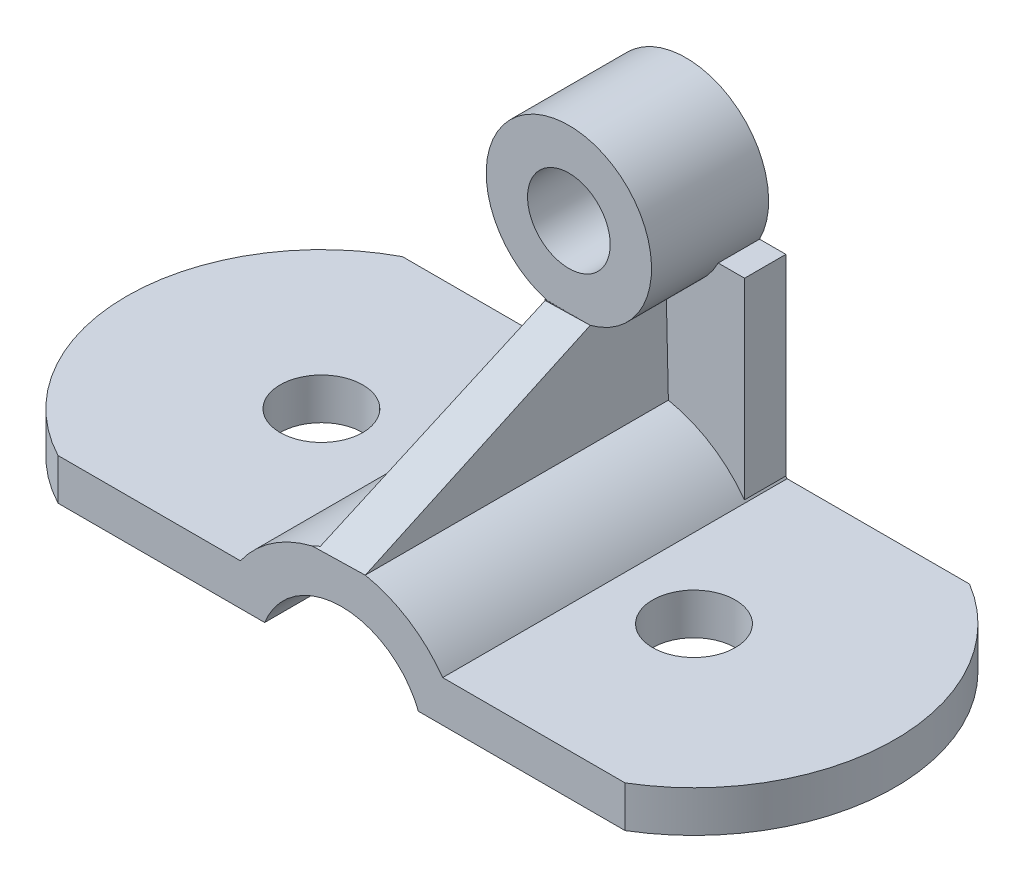
ISO-10303-21;
HEADER;
FILE_DESCRIPTION(('STEP AP214'),'2;1');
FILE_NAME('part.step','',(''),(''),'','','');
FILE_SCHEMA(('AUTOMOTIVE_DESIGN { 1 0 10303 214 1 1 1 1 }'));
ENDSEC;
DATA;
#1=APPLICATION_CONTEXT('core data for automotive mechanical design processes');
#2=APPLICATION_PROTOCOL_DEFINITION('international standard','automotive_design',2000,#1);
#3=PRODUCT_CONTEXT('',#1,'mechanical');
#4=PRODUCT('Part','Part','',(#3));
#5=PRODUCT_RELATED_PRODUCT_CATEGORY('part','',(#4));
#6=PRODUCT_DEFINITION_FORMATION('','',#4);
#7=PRODUCT_DEFINITION_CONTEXT('part definition',#1,'design');
#8=PRODUCT_DEFINITION('design','',#6,#7);
#9=PRODUCT_DEFINITION_SHAPE('','',#8);
#10=(LENGTH_UNIT() NAMED_UNIT(*) SI_UNIT(.MILLI.,.METRE.));
#11=(NAMED_UNIT(*) PLANE_ANGLE_UNIT() SI_UNIT($,.RADIAN.));
#12=(NAMED_UNIT(*) SI_UNIT($,.STERADIAN.) SOLID_ANGLE_UNIT());
#13=UNCERTAINTY_MEASURE_WITH_UNIT(LENGTH_MEASURE(1.E-05),#10,'distance_accuracy_value','');
#14=(GEOMETRIC_REPRESENTATION_CONTEXT(3) GLOBAL_UNCERTAINTY_ASSIGNED_CONTEXT((#13)) GLOBAL_UNIT_ASSIGNED_CONTEXT((#10,
#11,#12)) REPRESENTATION_CONTEXT('',''));
#15=CARTESIAN_POINT('',(0.,0.,0.));
#16=DIRECTION('',(0.,0.,1.));
#17=DIRECTION('',(1.,0.,0.));
#18=AXIS2_PLACEMENT_3D('',#15,#16,#17);
#19=CARTESIAN_POINT('',(22.3187070087078,-8.82469928436413,100.));
#20=DIRECTION('',(0.,0.,-1.));
#21=DIRECTION('',(-1.,0.,0.));
#22=AXIS2_PLACEMENT_3D('',#19,#20,#21);
#23=CYLINDRICAL_SURFACE('',#22,36.);
#24=DIRECTION('',(0.,0.,-1.));
#25=VECTOR('',#24,1.);
#26=CARTESIAN_POINT('',(29.206614960219,26.5102228756111,100.));
#27=LINE('',#26,#25);
#28=CARTESIAN_POINT('',(29.206614960219,26.5102228756111,100.));
#29=VERTEX_POINT('',#28);
#30=CARTESIAN_POINT('',(29.206614960219,26.5102228756111,12.));
#31=VERTEX_POINT('',#30);
#32=EDGE_CURVE('E274',#29,#31,#27,.T.);
#33=ORIENTED_EDGE('',*,*,#32,.F.);
#34=CARTESIAN_POINT('',(22.3187070087078,-8.82469928436413,100.));
#35=DIRECTION('',(0.,0.,1.));
#36=DIRECTION('',(1.,0.,0.));
#37=AXIS2_PLACEMENT_3D('',#34,#35,#36);
#38=CIRCLE('',#37,36.);
#39=CARTESIAN_POINT('',(51.6841952511295,12.,100.));
#40=VERTEX_POINT('',#39);
#41=EDGE_CURVE('E379',#40,#29,#38,.T.);
#42=ORIENTED_EDGE('',*,*,#41,.F.);
#43=DIRECTION('',(0.,0.,-1.));
#44=VECTOR('',#43,1.);
#45=CARTESIAN_POINT('',(51.6841952511295,12.,100.));
#46=LINE('',#45,#44);
#47=CARTESIAN_POINT('',(51.6841952511295,12.,0.));
#48=VERTEX_POINT('',#47);
#49=EDGE_CURVE('E415',#40,#48,#46,.T.);
#50=ORIENTED_EDGE('',*,*,#49,.T.);
#51=CARTESIAN_POINT('',(22.3187070087078,-8.82469928436413,0.));
#52=DIRECTION('',(0.,0.,1.));
#53=DIRECTION('',(1.,0.,0.));
#54=AXIS2_PLACEMENT_3D('',#51,#52,#53);
#55=CIRCLE('',#54,36.);
#56=CARTESIAN_POINT('',(51.3187070087078,12.5060297233374,0.));
#57=VERTEX_POINT('',#56);
#58=EDGE_CURVE('E401',#48,#57,#55,.T.);
#59=ORIENTED_EDGE('',*,*,#58,.T.);
#60=DIRECTION('',(0.,0.,-1.));
#61=VECTOR('',#60,1.);
#62=CARTESIAN_POINT('',(51.3187070087078,12.5060297233374,100.));
#63=LINE('',#62,#61);
#64=CARTESIAN_POINT('',(51.3187070087078,12.5060297233374,12.));
#65=VERTEX_POINT('',#64);
#66=EDGE_CURVE('E335',#65,#57,#63,.T.);
#67=ORIENTED_EDGE('',*,*,#66,.F.);
#68=CARTESIAN_POINT('',(22.3187070087078,-8.82469928436413,12.));
#69=DIRECTION('',(0.,0.,1.));
#70=DIRECTION('',(0.,-1.,0.));
#71=AXIS2_PLACEMENT_3D('',#68,#69,#70);
#72=CIRCLE('',#71,36.);
#73=EDGE_CURVE('E424',#65,#31,#72,.T.);
#74=ORIENTED_EDGE('',*,*,#73,.T.);
#75=EDGE_LOOP('',(#33,#42,#50,#59,#67,#74));
#76=FACE_BOUND('',#75,.T.);
#77=ADVANCED_FACE('F41',(#76),#23,.T.);
#78=CARTESIAN_POINT('',(13.8037736654294,26.1538071182759,100.));
#79=VERTEX_POINT('',#78);
#80=CARTESIAN_POINT('',(-7.04678123371384,12.,100.));
#81=VERTEX_POINT('',#80);
#82=EDGE_CURVE('E378',#79,#81,#38,.T.);
#83=ORIENTED_EDGE('',*,*,#82,.F.);
#84=CARTESIAN_POINT('',(22.3187070087078,-8.82469928436413,178.705674509862));
#85=DIRECTION('',(0.0211210367011272,-0.912765413968115,-0.407937741416855));
#86=DIRECTION('',(-0.00943699454614576,0.407828571836527,-0.913009747553505));
#87=AXIS2_PLACEMENT_3D('',#84,#85,#86);
#88=ELLIPSE('',#87,88.2487603989871,36.);
#89=CARTESIAN_POINT('',(15.4307990571966,26.5102228756111,99.2867551007535));
#90=VERTEX_POINT('',#89);
#91=EDGE_CURVE('E267',#79,#90,#88,.T.);
#92=ORIENTED_EDGE('',*,*,#91,.T.);
#93=DIRECTION('',(0.,0.,-1.));
#94=VECTOR('',#93,1.);
#95=CARTESIAN_POINT('',(15.4307990571966,26.5102228756111,100.));
#96=LINE('',#95,#94);
#97=CARTESIAN_POINT('',(15.4307990571967,26.5102228756111,12.));
#98=VERTEX_POINT('',#97);
#99=EDGE_CURVE('E277',#90,#98,#96,.T.);
#100=ORIENTED_EDGE('',*,*,#99,.T.);
#101=CARTESIAN_POINT('',(-1.68129299129219,18.0081164456333,12.));
#102=VERTEX_POINT('',#101);
#103=EDGE_CURVE('E421',#98,#102,#72,.T.);
#104=ORIENTED_EDGE('',*,*,#103,.T.);
#105=DIRECTION('',(0.,0.,-1.));
#106=VECTOR('',#105,1.);
#107=CARTESIAN_POINT('',(-1.68129299129219,18.0081164456333,100.));
#108=LINE('',#107,#106);
#109=CARTESIAN_POINT('',(-1.68129299129219,18.0081164456334,0.));
#110=VERTEX_POINT('',#109);
#111=EDGE_CURVE('E322',#102,#110,#108,.T.);
#112=ORIENTED_EDGE('',*,*,#111,.T.);
#113=CARTESIAN_POINT('',(-7.04678123371384,12.,0.));
#114=VERTEX_POINT('',#113);
#115=EDGE_CURVE('E400',#110,#114,#55,.T.);
#116=ORIENTED_EDGE('',*,*,#115,.T.);
#117=DIRECTION('',(0.,0.,-1.));
#118=VECTOR('',#117,1.);
#119=CARTESIAN_POINT('',(-7.04678123371384,12.,100.));
#120=LINE('',#119,#118);
#121=EDGE_CURVE('E412',#81,#114,#120,.T.);
#122=ORIENTED_EDGE('',*,*,#121,.F.);
#123=EDGE_LOOP('',(#83,#92,#100,#104,#112,#116,#122));
#124=FACE_BOUND('',#123,.T.);
#125=ADVANCED_FACE('F452',(#124),#23,.T.);
#126=CARTESIAN_POINT('',(51.3187070087078,68.2352134699063,12.));
#127=DIRECTION('',(0.,0.,1.));
#128=DIRECTION('',(0.,-1.,0.));
#129=AXIS2_PLACEMENT_3D('',#126,#127,#128);
#130=PLANE('',#129);
#131=CARTESIAN_POINT('',(22.3187070087078,79.1753007156359,12.));
#132=DIRECTION('',(0.,0.,1.));
#133=DIRECTION('',(0.,-1.,0.));
#134=AXIS2_PLACEMENT_3D('',#131,#132,#133);
#135=CIRCLE('',#134,24.);
#136=CARTESIAN_POINT('',(43.6802259400906,68.2352134699063,12.));
#137=VERTEX_POINT('',#136);
#138=CARTESIAN_POINT('',(28.5244298666703,55.9914916280385,12.));
#139=VERTEX_POINT('',#138);
#140=EDGE_CURVE('E300',#137,#139,#135,.F.);
#141=ORIENTED_EDGE('',*,*,#140,.T.);
#142=DIRECTION('',(0.0231334186274824,-0.999732386662854,0.));
#143=VECTOR('',#142,1.);
#144=CARTESIAN_POINT('',(28.2534649950084,67.7014927398735,12.));
#145=LINE('',#144,#143);
#146=EDGE_CURVE('E285',#139,#31,#145,.T.);
#147=ORIENTED_EDGE('',*,*,#146,.T.);
#148=ORIENTED_EDGE('',*,*,#73,.F.);
#149=DIRECTION('',(0.,1.,0.));
#150=VECTOR('',#149,1.);
#151=CARTESIAN_POINT('',(51.3187070087078,68.2352134699063,12.));
#152=LINE('',#151,#150);
#153=CARTESIAN_POINT('',(51.3187070087078,68.2352134699063,12.));
#154=VERTEX_POINT('',#153);
#155=EDGE_CURVE('E307',#65,#154,#152,.T.);
#156=ORIENTED_EDGE('',*,*,#155,.T.);
#157=DIRECTION('',(-1.,0.,0.));
#158=VECTOR('',#157,1.);
#159=CARTESIAN_POINT('',(51.3187070087078,68.2352134699063,12.));
#160=LINE('',#159,#158);
#161=EDGE_CURVE('E324',#154,#137,#160,.T.);
#162=ORIENTED_EDGE('',*,*,#161,.T.);
#163=EDGE_LOOP('',(#141,#147,#148,#156,#162));
#164=FACE_BOUND('',#163,.T.);
#165=ADVANCED_FACE('F468',(#164),#130,.T.);
#166=DIRECTION('',(0.,-1.,0.));
#167=VECTOR('',#166,1.);
#168=CARTESIAN_POINT('',(15.4307990571966,68.2352134699063,12.));
#169=LINE('',#168,#167);
#170=CARTESIAN_POINT('',(15.4307990571966,55.9914916280385,12.));
#171=VERTEX_POINT('',#170);
#172=EDGE_CURVE('E440',#171,#98,#169,.T.);
#173=ORIENTED_EDGE('',*,*,#172,.F.);
#174=DIRECTION('',(1.,0.,0.));
#175=VECTOR('',#174,1.);
#176=CARTESIAN_POINT('',(51.3187070087078,55.9914916280385,12.));
#177=LINE('',#176,#175);
#178=CARTESIAN_POINT('',(16.1129841507453,55.9914916280385,12.));
#179=VERTEX_POINT('',#178);
#180=EDGE_CURVE('E283',#171,#179,#177,.T.);
#181=ORIENTED_EDGE('',*,*,#180,.T.);
#182=CARTESIAN_POINT('',(0.957188077325033,68.2352134699063,12.));
#183=VERTEX_POINT('',#182);
#184=EDGE_CURVE('E297',#179,#183,#135,.F.);
#185=ORIENTED_EDGE('',*,*,#184,.T.);
#186=CARTESIAN_POINT('',(-1.68129299129219,68.2352134699063,12.));
#187=VERTEX_POINT('',#186);
#188=EDGE_CURVE('E327',#183,#187,#160,.T.);
#189=ORIENTED_EDGE('',*,*,#188,.T.);
#190=DIRECTION('',(0.,1.,0.));
#191=VECTOR('',#190,1.);
#192=CARTESIAN_POINT('',(-1.68129299129219,68.2352134699063,12.));
#193=LINE('',#192,#191);
#194=EDGE_CURVE('E315',#102,#187,#193,.T.);
#195=ORIENTED_EDGE('',*,*,#194,.F.);
#196=ORIENTED_EDGE('',*,*,#103,.F.);
#197=EDGE_LOOP('',(#173,#181,#185,#189,#195,#196));
#198=FACE_BOUND('',#197,.T.);
#199=ADVANCED_FACE('F490',(#198),#130,.T.);
#200=CARTESIAN_POINT('',(22.3187070087078,79.1753007156359,34.));
#201=DIRECTION('',(0.,0.,1.));
#202=DIRECTION('',(1.,0.,0.));
#203=AXIS2_PLACEMENT_3D('',#200,#201,#202);
#204=PLANE('',#203);
#205=CARTESIAN_POINT('',(22.3187070087078,79.1753007156359,34.));
#206=DIRECTION('',(0.,0.,1.));
#207=DIRECTION('',(1.,0.,0.));
#208=AXIS2_PLACEMENT_3D('',#205,#206,#207);
#209=CIRCLE('',#208,12.);
#210=CARTESIAN_POINT('',(34.3187070087078,79.1753007156359,34.));
#211=VERTEX_POINT('',#210);
#212=EDGE_CURVE('E288',#211,#211,#209,.T.);
#213=ORIENTED_EDGE('',*,*,#212,.F.);
#214=EDGE_LOOP('',(#213));
#215=FACE_BOUND('',#214,.T.);
#216=CARTESIAN_POINT('',(22.3187070087078,79.1753007156359,34.));
#217=DIRECTION('',(0.,0.,1.));
#218=DIRECTION('',(1.,0.,0.));
#219=AXIS2_PLACEMENT_3D('',#216,#217,#218);
#220=CIRCLE('',#219,24.);
#221=CARTESIAN_POINT('',(28.5244298666703,55.9914916280385,34.));
#222=VERTEX_POINT('',#221);
#223=CARTESIAN_POINT('',(16.1129841507453,55.9914916280385,34.));
#224=VERTEX_POINT('',#223);
#225=EDGE_CURVE('E294',#222,#224,#220,.T.);
#226=ORIENTED_EDGE('',*,*,#225,.T.);
#227=DIRECTION('',(1.,0.,0.));
#228=VECTOR('',#227,1.);
#229=CARTESIAN_POINT('',(22.3187070087078,55.9914916280385,34.));
#230=LINE('',#229,#228);
#231=EDGE_CURVE('E280',#224,#222,#230,.T.);
#232=ORIENTED_EDGE('',*,*,#231,.T.);
#233=EDGE_LOOP('',(#226,#232));
#234=FACE_BOUND('',#233,.T.);
#235=ADVANCED_FACE('F485',(#215,#234),#204,.T.);
#236=CARTESIAN_POINT('',(22.3187070087078,79.1753007156359,34.));
#237=DIRECTION('',(0.,0.,-1.));
#238=DIRECTION('',(-1.,0.,0.));
#239=AXIS2_PLACEMENT_3D('',#236,#237,#238);
#240=CYLINDRICAL_SURFACE('',#239,24.);
#241=DIRECTION('',(0.,0.,-1.));
#242=VECTOR('',#241,1.);
#243=CARTESIAN_POINT('',(16.1129841507453,55.9914916280385,34.));
#244=LINE('',#243,#242);
#245=EDGE_CURVE('E437',#224,#179,#244,.T.);
#246=ORIENTED_EDGE('',*,*,#245,.F.);
#247=ORIENTED_EDGE('',*,*,#225,.F.);
#248=DIRECTION('',(0.,0.,-1.));
#249=VECTOR('',#248,1.);
#250=CARTESIAN_POINT('',(28.5244298666703,55.9914916280385,34.));
#251=LINE('',#250,#249);
#252=EDGE_CURVE('E434',#139,#222,#251,.F.);
#253=ORIENTED_EDGE('',*,*,#252,.F.);
#254=ORIENTED_EDGE('',*,*,#140,.F.);
#255=DIRECTION('',(0.,0.,-1.));
#256=VECTOR('',#255,1.);
#257=CARTESIAN_POINT('',(43.6802259400906,68.2352134699063,34.));
#258=LINE('',#257,#256);
#259=CARTESIAN_POINT('',(43.6802259400906,68.2352134699063,0.));
#260=VERTEX_POINT('',#259);
#261=EDGE_CURVE('E432',#260,#137,#258,.F.);
#262=ORIENTED_EDGE('',*,*,#261,.F.);
#263=CARTESIAN_POINT('',(22.3187070087078,79.1753007156359,0.));
#264=DIRECTION('',(0.,0.,1.));
#265=DIRECTION('',(1.,0.,0.));
#266=AXIS2_PLACEMENT_3D('',#263,#264,#265);
#267=CIRCLE('',#266,24.);
#268=CARTESIAN_POINT('',(0.957188077325033,68.2352134699063,0.));
#269=VERTEX_POINT('',#268);
#270=EDGE_CURVE('E291',#260,#269,#267,.T.);
#271=ORIENTED_EDGE('',*,*,#270,.T.);
#272=DIRECTION('',(0.,0.,-1.));
#273=VECTOR('',#272,1.);
#274=CARTESIAN_POINT('',(0.957188077325033,68.2352134699063,34.));
#275=LINE('',#274,#273);
#276=EDGE_CURVE('E430',#183,#269,#275,.T.);
#277=ORIENTED_EDGE('',*,*,#276,.F.);
#278=ORIENTED_EDGE('',*,*,#184,.F.);
#279=EDGE_LOOP('',(#246,#247,#253,#254,#262,#271,#277,#278));
#280=FACE_BOUND('',#279,.T.);
#281=ADVANCED_FACE('F479',(#280),#240,.T.);
#282=CARTESIAN_POINT('',(51.3187070087078,68.2352134699063,0.));
#283=DIRECTION('',(0.,1.,0.));
#284=DIRECTION('',(-1.,0.,0.));
#285=AXIS2_PLACEMENT_3D('',#282,#283,#284);
#286=PLANE('',#285);
#287=DIRECTION('',(-1.,0.,0.));
#288=VECTOR('',#287,1.);
#289=CARTESIAN_POINT('',(51.3187070087078,68.2352134699063,0.));
#290=LINE('',#289,#288);
#291=CARTESIAN_POINT('',(51.3187070087078,68.2352134699063,0.));
#292=VERTEX_POINT('',#291);
#293=EDGE_CURVE('E320',#292,#260,#290,.T.);
#294=ORIENTED_EDGE('',*,*,#293,.T.);
#295=ORIENTED_EDGE('',*,*,#261,.T.);
#296=ORIENTED_EDGE('',*,*,#161,.F.);
#297=DIRECTION('',(0.,0.,-1.));
#298=VECTOR('',#297,1.);
#299=CARTESIAN_POINT('',(51.3187070087078,68.2352134699063,0.));
#300=LINE('',#299,#298);
#301=EDGE_CURVE('E310',#154,#292,#300,.T.);
#302=ORIENTED_EDGE('',*,*,#301,.T.);
#303=EDGE_LOOP('',(#294,#295,#296,#302));
#304=FACE_BOUND('',#303,.T.);
#305=ADVANCED_FACE('F475',(#304),#286,.T.);
#306=ORIENTED_EDGE('',*,*,#188,.F.);
#307=ORIENTED_EDGE('',*,*,#276,.T.);
#308=CARTESIAN_POINT('',(-1.68129299129219,68.2352134699063,0.));
#309=VERTEX_POINT('',#308);
#310=EDGE_CURVE('E323',#269,#309,#290,.T.);
#311=ORIENTED_EDGE('',*,*,#310,.T.);
#312=DIRECTION('',(0.,0.,-1.));
#313=VECTOR('',#312,1.);
#314=CARTESIAN_POINT('',(-1.68129299129219,68.2352134699063,0.));
#315=LINE('',#314,#313);
#316=EDGE_CURVE('E308',#187,#309,#315,.T.);
#317=ORIENTED_EDGE('',*,*,#316,.F.);
#318=EDGE_LOOP('',(#306,#307,#311,#317));
#319=FACE_BOUND('',#318,.T.);
#320=ADVANCED_FACE('F495',(#319),#286,.T.);
#321=CARTESIAN_POINT('',(22.3187070087078,-8.82469928436413,100.));
#322=DIRECTION('',(0.,0.,-1.));
#323=DIRECTION('',(-1.,0.,0.));
#324=AXIS2_PLACEMENT_3D('',#321,#322,#323);
#325=CYLINDRICAL_SURFACE('',#324,24.);
#326=CARTESIAN_POINT('',(22.3187070087078,-8.82469928436413,0.));
#327=DIRECTION('',(0.,0.,-1.));
#328=DIRECTION('',(-1.,0.,0.));
#329=AXIS2_PLACEMENT_3D('',#326,#327,#328);
#330=CIRCLE('',#329,24.);
#331=CARTESIAN_POINT('',(0.,0.,0.));
#332=VERTEX_POINT('',#331);
#333=CARTESIAN_POINT('',(10.3884136461872,12.,0.));
#334=VERTEX_POINT('',#333);
#335=EDGE_CURVE('E389',#332,#334,#330,.T.);
#336=ORIENTED_EDGE('',*,*,#335,.T.);
#337=DIRECTION('',(0.,0.,-1.));
#338=VECTOR('',#337,1.);
#339=CARTESIAN_POINT('',(10.3884136461872,12.,100.));
#340=LINE('',#339,#338);
#341=CARTESIAN_POINT('',(10.3884136461872,12.,12.));
#342=VERTEX_POINT('',#341);
#343=EDGE_CURVE('E340',#334,#342,#340,.F.);
#344=ORIENTED_EDGE('',*,*,#343,.T.);
#345=CARTESIAN_POINT('',(22.3187070087078,-8.82469928436413,12.));
#346=DIRECTION('',(0.,0.,1.));
#347=DIRECTION('',(0.,-1.,0.));
#348=AXIS2_PLACEMENT_3D('',#345,#346,#347);
#349=CIRCLE('',#348,24.);
#350=CARTESIAN_POINT('',(34.2490003712285,12.,12.));
#351=VERTEX_POINT('',#350);
#352=EDGE_CURVE('E343',#342,#351,#349,.F.);
#353=ORIENTED_EDGE('',*,*,#352,.T.);
#354=DIRECTION('',(0.,0.,-1.));
#355=VECTOR('',#354,1.);
#356=CARTESIAN_POINT('',(34.2490003712285,12.,100.));
#357=LINE('',#356,#355);
#358=CARTESIAN_POINT('',(34.2490003712285,12.,0.));
#359=VERTEX_POINT('',#358);
#360=EDGE_CURVE('E337',#351,#359,#357,.T.);
#361=ORIENTED_EDGE('',*,*,#360,.T.);
#362=CARTESIAN_POINT('',(44.6374140174156,0.,0.));
#363=VERTEX_POINT('',#362);
#364=EDGE_CURVE('E393',#359,#363,#330,.T.);
#365=ORIENTED_EDGE('',*,*,#364,.T.);
#366=DIRECTION('',(0.,0.,-1.));
#367=VECTOR('',#366,1.);
#368=CARTESIAN_POINT('',(44.6374140174156,0.,100.));
#369=LINE('',#368,#367);
#370=CARTESIAN_POINT('',(44.6374140174156,0.,100.));
#371=VERTEX_POINT('',#370);
#372=EDGE_CURVE('E418',#371,#363,#369,.T.);
#373=ORIENTED_EDGE('',*,*,#372,.F.);
#374=CARTESIAN_POINT('',(22.3187070087078,-8.82469928436413,100.));
#375=DIRECTION('',(0.,0.,-1.));
#376=DIRECTION('',(-1.,0.,0.));
#377=AXIS2_PLACEMENT_3D('',#374,#375,#376);
#378=CIRCLE('',#377,24.);
#379=CARTESIAN_POINT('',(0.,0.,100.));
#380=VERTEX_POINT('',#379);
#381=EDGE_CURVE('E368',#380,#371,#378,.T.);
#382=ORIENTED_EDGE('',*,*,#381,.F.);
#383=DIRECTION('',(0.,0.,-1.));
#384=VECTOR('',#383,1.);
#385=CARTESIAN_POINT('',(0.,0.,100.));
#386=LINE('',#385,#384);
#387=EDGE_CURVE('E388',#380,#332,#386,.T.);
#388=ORIENTED_EDGE('',*,*,#387,.T.);
#389=EDGE_LOOP('',(#336,#344,#353,#361,#365,#373,#382,#388));
#390=FACE_BOUND('',#389,.T.);
#391=ADVANCED_FACE('F43',(#390),#325,.F.);
#392=CARTESIAN_POINT('',(44.6374140174156,0.,100.));
#393=DIRECTION('',(0.,1.,0.));
#394=DIRECTION('',(-1.,0.,0.));
#395=AXIS2_PLACEMENT_3D('',#392,#393,#394);
#396=PLANE('',#395);
#397=CARTESIAN_POINT('',(74.6374140174156,0.,50.));
#398=DIRECTION('',(0.,1.,0.));
#399=DIRECTION('',(0.,0.,1.));
#400=AXIS2_PLACEMENT_3D('',#397,#398,#399);
#401=CIRCLE('',#400,12.);
#402=CARTESIAN_POINT('',(74.6374140174156,0.,62.));
#403=VERTEX_POINT('',#402);
#404=EDGE_CURVE('E356',#403,#403,#401,.T.);
#405=ORIENTED_EDGE('',*,*,#404,.T.);
#406=EDGE_LOOP('',(#405));
#407=FACE_BOUND('',#406,.T.);
#408=DIRECTION('',(1.,0.,0.));
#409=VECTOR('',#408,1.);
#410=CARTESIAN_POINT('',(44.6374140174156,0.,0.));
#411=LINE('',#410,#409);
#412=CARTESIAN_POINT('',(104.637414017416,0.,0.));
#413=VERTEX_POINT('',#412);
#414=EDGE_CURVE('E392',#363,#413,#411,.T.);
#415=ORIENTED_EDGE('',*,*,#414,.T.);
#416=CARTESIAN_POINT('',(74.6374140174156,0.,50.));
#417=DIRECTION('',(0.,1.,0.));
#418=DIRECTION('',(0.,0.,1.));
#419=AXIS2_PLACEMENT_3D('',#416,#417,#418);
#420=CIRCLE('',#419,58.309518948453);
#421=CARTESIAN_POINT('',(104.637414017416,0.,100.));
#422=VERTEX_POINT('',#421);
#423=EDGE_CURVE('E346',#422,#413,#420,.T.);
#424=ORIENTED_EDGE('',*,*,#423,.F.);
#425=DIRECTION('',(1.,0.,0.));
#426=VECTOR('',#425,1.);
#427=CARTESIAN_POINT('',(44.6374140174156,0.,100.));
#428=LINE('',#427,#426);
#429=EDGE_CURVE('E371',#371,#422,#428,.T.);
#430=ORIENTED_EDGE('',*,*,#429,.F.);
#431=ORIENTED_EDGE('',*,*,#372,.T.);
#432=EDGE_LOOP('',(#415,#424,#430,#431));
#433=FACE_BOUND('',#432,.T.);
#434=ADVANCED_FACE('F529',(#407,#433),#396,.F.);
#435=CARTESIAN_POINT('',(104.637414017416,12.,100.));
#436=DIRECTION('',(0.,-1.,0.));
#437=DIRECTION('',(1.,0.,0.));
#438=AXIS2_PLACEMENT_3D('',#435,#436,#437);
#439=PLANE('',#438);
#440=CARTESIAN_POINT('',(74.6374140174156,12.,50.));
#441=DIRECTION('',(0.,-1.,0.));
#442=DIRECTION('',(1.,0.,0.));
#443=AXIS2_PLACEMENT_3D('',#440,#441,#442);
#444=CIRCLE('',#443,12.);
#445=CARTESIAN_POINT('',(86.6374140174156,12.,50.));
#446=VERTEX_POINT('',#445);
#447=EDGE_CURVE('E367',#446,#446,#444,.F.);
#448=ORIENTED_EDGE('',*,*,#447,.F.);
#449=EDGE_LOOP('',(#448));
#450=FACE_BOUND('',#449,.T.);
#451=DIRECTION('',(-1.,0.,0.));
#452=VECTOR('',#451,1.);
#453=CARTESIAN_POINT('',(104.637414017416,12.,0.));
#454=LINE('',#453,#452);
#455=CARTESIAN_POINT('',(104.637414017416,12.,0.));
#456=VERTEX_POINT('',#455);
#457=EDGE_CURVE('E398',#456,#48,#454,.T.);
#458=ORIENTED_EDGE('',*,*,#457,.T.);
#459=ORIENTED_EDGE('',*,*,#49,.F.);
#460=DIRECTION('',(-1.,0.,0.));
#461=VECTOR('',#460,1.);
#462=CARTESIAN_POINT('',(104.637414017416,12.,100.));
#463=LINE('',#462,#461);
#464=CARTESIAN_POINT('',(104.637414017416,12.,100.));
#465=VERTEX_POINT('',#464);
#466=EDGE_CURVE('E376',#465,#40,#463,.T.);
#467=ORIENTED_EDGE('',*,*,#466,.F.);
#468=CARTESIAN_POINT('',(74.6374140174156,12.,50.));
#469=DIRECTION('',(0.,1.,0.));
#470=DIRECTION('',(0.,0.,1.));
#471=AXIS2_PLACEMENT_3D('',#468,#469,#470);
#472=CIRCLE('',#471,58.309518948453);
#473=EDGE_CURVE('E347',#465,#456,#472,.T.);
#474=ORIENTED_EDGE('',*,*,#473,.T.);
#475=EDGE_LOOP('',(#458,#459,#467,#474));
#476=FACE_BOUND('',#475,.T.);
#477=ADVANCED_FACE('F536',(#450,#476),#439,.F.);
#478=CARTESIAN_POINT('',(-60.,12.,100.));
#479=DIRECTION('',(0.,-1.,0.));
#480=DIRECTION('',(1.,0.,0.));
#481=AXIS2_PLACEMENT_3D('',#478,#479,#480);
#482=PLANE('',#481);
#483=CARTESIAN_POINT('',(-33.5233906168569,12.,50.));
#484=DIRECTION('',(0.,-1.,0.));
#485=DIRECTION('',(1.,0.,0.));
#486=AXIS2_PLACEMENT_3D('',#483,#484,#485);
#487=CIRCLE('',#486,12.);
#488=CARTESIAN_POINT('',(-21.5233906168569,12.,50.));
#489=VERTEX_POINT('',#488);
#490=EDGE_CURVE('E362',#489,#489,#487,.F.);
#491=ORIENTED_EDGE('',*,*,#490,.F.);
#492=EDGE_LOOP('',(#491));
#493=FACE_BOUND('',#492,.T.);
#494=DIRECTION('',(-1.,0.,0.));
#495=VECTOR('',#494,1.);
#496=CARTESIAN_POINT('',(-60.,12.,0.));
#497=LINE('',#496,#495);
#498=CARTESIAN_POINT('',(-60.,12.,0.));
#499=VERTEX_POINT('',#498);
#500=EDGE_CURVE('E404',#114,#499,#497,.T.);
#501=ORIENTED_EDGE('',*,*,#500,.T.);
#502=CARTESIAN_POINT('',(-33.5233906168569,12.,50.));
#503=DIRECTION('',(0.,1.,0.));
#504=DIRECTION('',(0.,0.,-1.));
#505=AXIS2_PLACEMENT_3D('',#502,#503,#504);
#506=CIRCLE('',#505,56.5774764763111);
#507=CARTESIAN_POINT('',(-60.,12.,100.));
#508=VERTEX_POINT('',#507);
#509=EDGE_CURVE('E353',#499,#508,#506,.T.);
#510=ORIENTED_EDGE('',*,*,#509,.T.);
#511=DIRECTION('',(-1.,0.,0.));
#512=VECTOR('',#511,1.);
#513=CARTESIAN_POINT('',(-60.,12.,100.));
#514=LINE('',#513,#512);
#515=EDGE_CURVE('E382',#81,#508,#514,.T.);
#516=ORIENTED_EDGE('',*,*,#515,.F.);
#517=ORIENTED_EDGE('',*,*,#121,.T.);
#518=EDGE_LOOP('',(#501,#510,#516,#517));
#519=FACE_BOUND('',#518,.T.);
#520=ADVANCED_FACE('F507',(#493,#519),#482,.F.);
#521=CARTESIAN_POINT('',(0.,0.,100.));
#522=DIRECTION('',(0.,1.,0.));
#523=DIRECTION('',(-1.,0.,0.));
#524=AXIS2_PLACEMENT_3D('',#521,#522,#523);
#525=PLANE('',#524);
#526=CARTESIAN_POINT('',(-33.5233906168569,0.,50.));
#527=DIRECTION('',(0.,1.,0.));
#528=DIRECTION('',(0.,0.,1.));
#529=AXIS2_PLACEMENT_3D('',#526,#527,#528);
#530=CIRCLE('',#529,12.);
#531=CARTESIAN_POINT('',(-33.5233906168569,0.,62.));
#532=VERTEX_POINT('',#531);
#533=EDGE_CURVE('E359',#532,#532,#530,.T.);
#534=ORIENTED_EDGE('',*,*,#533,.T.);
#535=EDGE_LOOP('',(#534));
#536=FACE_BOUND('',#535,.T.);
#537=DIRECTION('',(1.,0.,0.));
#538=VECTOR('',#537,1.);
#539=CARTESIAN_POINT('',(0.,0.,0.));
#540=LINE('',#539,#538);
#541=CARTESIAN_POINT('',(-59.9999999999999,0.,0.));
#542=VERTEX_POINT('',#541);
#543=EDGE_CURVE('E372',#542,#332,#540,.T.);
#544=ORIENTED_EDGE('',*,*,#543,.T.);
#545=ORIENTED_EDGE('',*,*,#387,.F.);
#546=DIRECTION('',(1.,0.,0.));
#547=VECTOR('',#546,1.);
#548=CARTESIAN_POINT('',(0.,0.,100.));
#549=LINE('',#548,#547);
#550=CARTESIAN_POINT('',(-60.,0.,100.));
#551=VERTEX_POINT('',#550);
#552=EDGE_CURVE('E386',#551,#380,#549,.T.);
#553=ORIENTED_EDGE('',*,*,#552,.F.);
#554=CARTESIAN_POINT('',(-33.5233906168569,0.,50.));
#555=DIRECTION('',(0.,1.,0.));
#556=DIRECTION('',(0.,0.,-1.));
#557=AXIS2_PLACEMENT_3D('',#554,#555,#556);
#558=CIRCLE('',#557,56.5774764763111);
#559=EDGE_CURVE('E350',#542,#551,#558,.T.);
#560=ORIENTED_EDGE('',*,*,#559,.F.);
#561=EDGE_LOOP('',(#544,#545,#553,#560));
#562=FACE_BOUND('',#561,.T.);
#563=ADVANCED_FACE('F518',(#536,#562),#525,.F.);
#564=CARTESIAN_POINT('',(22.3187070087078,-8.82469928436413,100.));
#565=DIRECTION('',(0.,0.,-1.));
#566=DIRECTION('',(-1.,0.,0.));
#567=AXIS2_PLACEMENT_3D('',#564,#565,#566);
#568=PLANE('',#567);
#569=ORIENTED_EDGE('',*,*,#41,.T.);
#570=DIRECTION('',(0.999732386662854,0.0231334186274824,0.));
#571=VECTOR('',#570,1.);
#572=CARTESIAN_POINT('',(-70.7666237060664,24.1968810128629,100.));
#573=LINE('',#572,#571);
#574=EDGE_CURVE('E265',#79,#29,#573,.T.);
#575=ORIENTED_EDGE('',*,*,#574,.F.);
#576=ORIENTED_EDGE('',*,*,#82,.T.);
#577=ORIENTED_EDGE('',*,*,#515,.T.);
#578=DIRECTION('',(0.,-1.,0.));
#579=VECTOR('',#578,1.);
#580=CARTESIAN_POINT('',(-60.,0.,100.));
#581=LINE('',#580,#579);
#582=EDGE_CURVE('E384',#508,#551,#581,.T.);
#583=ORIENTED_EDGE('',*,*,#582,.T.);
#584=ORIENTED_EDGE('',*,*,#552,.T.);
#585=ORIENTED_EDGE('',*,*,#381,.T.);
#586=ORIENTED_EDGE('',*,*,#429,.T.);
#587=DIRECTION('',(0.,1.,0.));
#588=VECTOR('',#587,1.);
#589=CARTESIAN_POINT('',(104.637414017416,0.,100.));
#590=LINE('',#589,#588);
#591=EDGE_CURVE('E374',#422,#465,#590,.T.);
#592=ORIENTED_EDGE('',*,*,#591,.T.);
#593=ORIENTED_EDGE('',*,*,#466,.T.);
#594=EDGE_LOOP('',(#569,#575,#576,#577,#583,#584,#585,#586,#592,#593));
#595=FACE_BOUND('',#594,.T.);
#596=ADVANCED_FACE('F457',(#595),#568,.F.);
#597=CARTESIAN_POINT('',(22.3187070087078,-8.82469928436413,0.));
#598=DIRECTION('',(0.,0.,-1.));
#599=DIRECTION('',(-1.,0.,0.));
#600=AXIS2_PLACEMENT_3D('',#597,#598,#599);
#601=PLANE('',#600);
#602=DIRECTION('',(0.,1.,0.));
#603=VECTOR('',#602,1.);
#604=CARTESIAN_POINT('',(17.3877343809371,66.2352134699063,0.));
#605=LINE('',#604,#603);
#606=CARTESIAN_POINT('',(17.3877343809371,66.2352134699063,0.));
#607=VERTEX_POINT('',#606);
#608=CARTESIAN_POINT('',(17.3877343809371,68.2352134699063,0.));
#609=VERTEX_POINT('',#608);
#610=EDGE_CURVE('E257',#607,#609,#605,.T.);
#611=ORIENTED_EDGE('',*,*,#610,.F.);
#612=DIRECTION('',(-1.,0.,0.));
#613=VECTOR('',#612,1.);
#614=CARTESIAN_POINT('',(17.3877343809371,66.2352134699063,0.));
#615=LINE('',#614,#613);
#616=CARTESIAN_POINT('',(28.018752880115,66.2352134699063,0.));
#617=VERTEX_POINT('',#616);
#618=EDGE_CURVE('E232',#617,#607,#615,.T.);
#619=ORIENTED_EDGE('',*,*,#618,.F.);
#620=DIRECTION('',(0.,1.,0.));
#621=VECTOR('',#620,1.);
#622=CARTESIAN_POINT('',(28.018752880115,66.2352134699063,0.));
#623=LINE('',#622,#621);
#624=CARTESIAN_POINT('',(28.018752880115,68.2352134699063,0.));
#625=VERTEX_POINT('',#624);
#626=EDGE_CURVE('E260',#617,#625,#623,.T.);
#627=ORIENTED_EDGE('',*,*,#626,.T.);
#628=DIRECTION('',(-1.,0.,0.));
#629=VECTOR('',#628,1.);
#630=CARTESIAN_POINT('',(17.3877343809371,68.2352134699063,0.));
#631=LINE('',#630,#629);
#632=CARTESIAN_POINT('',(27.2496796364786,68.2352134699063,0.));
#633=VERTEX_POINT('',#632);
#634=EDGE_CURVE('E246',#625,#633,#631,.T.);
#635=ORIENTED_EDGE('',*,*,#634,.T.);
#636=CARTESIAN_POINT('',(22.3187070087078,79.1753007156359,0.));
#637=DIRECTION('',(0.,0.,1.));
#638=DIRECTION('',(1.,0.,0.));
#639=AXIS2_PLACEMENT_3D('',#636,#637,#638);
#640=CIRCLE('',#639,12.);
#641=EDGE_CURVE('E287',#633,#609,#640,.T.);
#642=ORIENTED_EDGE('',*,*,#641,.T.);
#643=EDGE_LOOP('',(#611,#619,#627,#635,#642));
#644=FACE_BOUND('',#643,.T.);
#645=ORIENTED_EDGE('',*,*,#310,.F.);
#646=ORIENTED_EDGE('',*,*,#270,.F.);
#647=ORIENTED_EDGE('',*,*,#293,.F.);
#648=DIRECTION('',(0.,-1.,0.));
#649=VECTOR('',#648,1.);
#650=CARTESIAN_POINT('',(51.3187070087078,68.2352134699063,0.));
#651=LINE('',#650,#649);
#652=EDGE_CURVE('E304',#292,#57,#651,.T.);
#653=ORIENTED_EDGE('',*,*,#652,.T.);
#654=ORIENTED_EDGE('',*,*,#58,.F.);
#655=ORIENTED_EDGE('',*,*,#457,.F.);
#656=DIRECTION('',(0.,1.,0.));
#657=VECTOR('',#656,1.);
#658=CARTESIAN_POINT('',(104.637414017416,0.,0.));
#659=LINE('',#658,#657);
#660=EDGE_CURVE('E395',#413,#456,#659,.T.);
#661=ORIENTED_EDGE('',*,*,#660,.F.);
#662=ORIENTED_EDGE('',*,*,#414,.F.);
#663=ORIENTED_EDGE('',*,*,#364,.F.);
#664=DIRECTION('',(-1.,0.,0.));
#665=VECTOR('',#664,1.);
#666=CARTESIAN_POINT('',(51.3187070087078,12.,0.));
#667=LINE('',#666,#665);
#668=EDGE_CURVE('E313',#359,#334,#667,.T.);
#669=ORIENTED_EDGE('',*,*,#668,.T.);
#670=ORIENTED_EDGE('',*,*,#335,.F.);
#671=ORIENTED_EDGE('',*,*,#543,.F.);
#672=DIRECTION('',(0.,-1.,0.));
#673=VECTOR('',#672,1.);
#674=CARTESIAN_POINT('',(-60.,0.,0.));
#675=LINE('',#674,#673);
#676=EDGE_CURVE('E406',#499,#542,#675,.T.);
#677=ORIENTED_EDGE('',*,*,#676,.F.);
#678=ORIENTED_EDGE('',*,*,#500,.F.);
#679=ORIENTED_EDGE('',*,*,#115,.F.);
#680=DIRECTION('',(0.,-1.,0.));
#681=VECTOR('',#680,1.);
#682=CARTESIAN_POINT('',(-1.68129299129219,68.2352134699063,0.));
#683=LINE('',#682,#681);
#684=EDGE_CURVE('E303',#309,#110,#683,.T.);
#685=ORIENTED_EDGE('',*,*,#684,.F.);
#686=EDGE_LOOP('',(#645,#646,#647,#653,#654,#655,#661,#662,#663,#669,#670,#671,#677,#678,#679,#685));
#687=FACE_BOUND('',#686,.T.);
#688=ADVANCED_FACE('F499',(#644,#687),#601,.T.);
#689=CARTESIAN_POINT('',(-33.5233906168569,100.,50.));
#690=DIRECTION('',(0.,-1.,0.));
#691=DIRECTION('',(0.,0.,-1.));
#692=AXIS2_PLACEMENT_3D('',#689,#690,#691);
#693=CYLINDRICAL_SURFACE('',#692,12.);
#694=ORIENTED_EDGE('',*,*,#533,.F.);
#695=EDGE_LOOP('',(#694));
#696=FACE_BOUND('',#695,.T.);
#697=ORIENTED_EDGE('',*,*,#490,.T.);
#698=EDGE_LOOP('',(#697));
#699=FACE_BOUND('',#698,.T.);
#700=ADVANCED_FACE('F559',(#696,#699),#693,.F.);
#701=CARTESIAN_POINT('',(74.6374140174156,100.,50.));
#702=DIRECTION('',(0.,-1.,0.));
#703=DIRECTION('',(0.,0.,-1.));
#704=AXIS2_PLACEMENT_3D('',#701,#702,#703);
#705=CYLINDRICAL_SURFACE('',#704,12.);
#706=ORIENTED_EDGE('',*,*,#404,.F.);
#707=EDGE_LOOP('',(#706));
#708=FACE_BOUND('',#707,.T.);
#709=ORIENTED_EDGE('',*,*,#447,.T.);
#710=EDGE_LOOP('',(#709));
#711=FACE_BOUND('',#710,.T.);
#712=ADVANCED_FACE('F563',(#708,#711),#705,.F.);
#713=CARTESIAN_POINT('',(-33.5233906168569,12.,50.));
#714=DIRECTION('',(0.,-1.,0.));
#715=DIRECTION('',(0.,0.,-1.));
#716=AXIS2_PLACEMENT_3D('',#713,#714,#715);
#717=CYLINDRICAL_SURFACE('',#716,56.5774764763111);
#718=ORIENTED_EDGE('',*,*,#559,.T.);
#719=ORIENTED_EDGE('',*,*,#582,.F.);
#720=ORIENTED_EDGE('',*,*,#509,.F.);
#721=ORIENTED_EDGE('',*,*,#676,.T.);
#722=EDGE_LOOP('',(#718,#719,#720,#721));
#723=FACE_BOUND('',#722,.T.);
#724=ADVANCED_FACE('F514',(#723),#717,.T.);
#725=CARTESIAN_POINT('',(74.6374140174156,12.,50.));
#726=DIRECTION('',(0.,-1.,0.));
#727=DIRECTION('',(0.,0.,-1.));
#728=AXIS2_PLACEMENT_3D('',#725,#726,#727);
#729=CYLINDRICAL_SURFACE('',#728,58.309518948453);
#730=ORIENTED_EDGE('',*,*,#423,.T.);
#731=ORIENTED_EDGE('',*,*,#660,.T.);
#732=ORIENTED_EDGE('',*,*,#473,.F.);
#733=ORIENTED_EDGE('',*,*,#591,.F.);
#734=EDGE_LOOP('',(#730,#731,#732,#733));
#735=FACE_BOUND('',#734,.T.);
#736=ADVANCED_FACE('F528',(#735),#729,.T.);
#737=CARTESIAN_POINT('',(-1.68129299129219,0.,0.));
#738=DIRECTION('',(-1.,0.,0.));
#739=DIRECTION('',(0.,-1.,0.));
#740=AXIS2_PLACEMENT_3D('',#737,#738,#739);
#741=PLANE('',#740);
#742=ORIENTED_EDGE('',*,*,#111,.F.);
#743=ORIENTED_EDGE('',*,*,#194,.T.);
#744=ORIENTED_EDGE('',*,*,#316,.T.);
#745=ORIENTED_EDGE('',*,*,#684,.T.);
#746=EDGE_LOOP('',(#742,#743,#744,#745));
#747=FACE_BOUND('',#746,.T.);
#748=ADVANCED_FACE('F504',(#747),#741,.T.);
#749=CARTESIAN_POINT('',(51.3187070087078,0.,0.));
#750=DIRECTION('',(-1.,0.,0.));
#751=DIRECTION('',(0.,-1.,0.));
#752=AXIS2_PLACEMENT_3D('',#749,#750,#751);
#753=PLANE('',#752);
#754=ORIENTED_EDGE('',*,*,#155,.F.);
#755=ORIENTED_EDGE('',*,*,#66,.T.);
#756=ORIENTED_EDGE('',*,*,#652,.F.);
#757=ORIENTED_EDGE('',*,*,#301,.F.);
#758=EDGE_LOOP('',(#754,#755,#756,#757));
#759=FACE_BOUND('',#758,.T.);
#760=ADVANCED_FACE('F472',(#759),#753,.F.);
#761=ORIENTED_EDGE('',*,*,#352,.F.);
#762=DIRECTION('',(-1.,0.,0.));
#763=VECTOR('',#762,1.);
#764=CARTESIAN_POINT('',(51.3187070087078,12.,12.));
#765=LINE('',#764,#763);
#766=EDGE_CURVE('E328',#351,#342,#765,.T.);
#767=ORIENTED_EDGE('',*,*,#766,.F.);
#768=EDGE_LOOP('',(#761,#767));
#769=FACE_BOUND('',#768,.T.);
#770=ADVANCED_FACE('F578',(#769),#130,.T.);
#771=CARTESIAN_POINT('',(51.3187070087078,12.,0.));
#772=DIRECTION('',(0.,-1.,0.));
#773=DIRECTION('',(1.,0.,0.));
#774=AXIS2_PLACEMENT_3D('',#771,#772,#773);
#775=PLANE('',#774);
#776=ORIENTED_EDGE('',*,*,#343,.F.);
#777=ORIENTED_EDGE('',*,*,#668,.F.);
#778=ORIENTED_EDGE('',*,*,#360,.F.);
#779=ORIENTED_EDGE('',*,*,#766,.T.);
#780=EDGE_LOOP('',(#776,#777,#778,#779));
#781=FACE_BOUND('',#780,.T.);
#782=ADVANCED_FACE('F574',(#781),#775,.T.);
#783=CARTESIAN_POINT('',(22.3187070087078,79.1753007156359,34.));
#784=DIRECTION('',(0.,0.,-1.));
#785=DIRECTION('',(-1.,0.,0.));
#786=AXIS2_PLACEMENT_3D('',#783,#784,#785);
#787=CYLINDRICAL_SURFACE('',#786,12.);
#788=DIRECTION('',(0.,0.,-1.));
#789=VECTOR('',#788,1.);
#790=CARTESIAN_POINT('',(27.2496796364786,68.2352134699063,34.));
#791=LINE('',#790,#789);
#792=CARTESIAN_POINT('',(27.2496796364786,68.2352134699063,16.9639634755185));
#793=VERTEX_POINT('',#792);
#794=EDGE_CURVE('E428',#633,#793,#791,.F.);
#795=ORIENTED_EDGE('',*,*,#794,.T.);
#796=CARTESIAN_POINT('',(22.3187070087078,79.1753007156359,16.9639634755185));
#797=DIRECTION('',(0.,0.,1.));
#798=DIRECTION('',(1.,0.,0.));
#799=AXIS2_PLACEMENT_3D('',#796,#797,#798);
#800=CIRCLE('',#799,12.);
#801=CARTESIAN_POINT('',(17.3877343809371,68.2352134699063,16.9639634755185));
#802=VERTEX_POINT('',#801);
#803=EDGE_CURVE('E11',#802,#793,#800,.T.);
#804=ORIENTED_EDGE('',*,*,#803,.F.);
#805=DIRECTION('',(0.,0.,-1.));
#806=VECTOR('',#805,1.);
#807=CARTESIAN_POINT('',(17.3877343809371,68.2352134699063,34.));
#808=LINE('',#807,#806);
#809=EDGE_CURVE('E228',#802,#609,#808,.T.);
#810=ORIENTED_EDGE('',*,*,#809,.T.);
#811=ORIENTED_EDGE('',*,*,#641,.F.);
#812=EDGE_LOOP('',(#795,#804,#810,#811));
#813=FACE_BOUND('',#812,.T.);
#814=ORIENTED_EDGE('',*,*,#212,.T.);
#815=EDGE_LOOP('',(#814));
#816=FACE_BOUND('',#815,.T.);
#817=ADVANCED_FACE('F577',(#813,#816),#787,.F.);
#818=CARTESIAN_POINT('',(29.8040928564141,0.68965511776733,100.));
#819=DIRECTION('',(-0.999732386662854,-0.0231334186274824,0.));
#820=DIRECTION('',(0.0231334186274824,-0.999732386662854,0.));
#821=AXIS2_PLACEMENT_3D('',#818,#819,#820);
#822=PLANE('',#821);
#823=ORIENTED_EDGE('',*,*,#252,.T.);
#824=DIRECTION('',(-0.00943699454614576,0.407828571836527,-0.913009747553505));
#825=VECTOR('',#824,1.);
#826=CARTESIAN_POINT('',(28.5244298666703,55.9914916280385,34.));
#827=LINE('',#826,#825);
#828=EDGE_CURVE('E259',#29,#222,#827,.T.);
#829=ORIENTED_EDGE('',*,*,#828,.F.);
#830=ORIENTED_EDGE('',*,*,#32,.T.);
#831=ORIENTED_EDGE('',*,*,#146,.F.);
#832=EDGE_LOOP('',(#823,#829,#830,#831));
#833=FACE_BOUND('',#832,.T.);
#834=ADVANCED_FACE('F462',(#833),#822,.F.);
#835=CARTESIAN_POINT('',(0.,55.9914916280385,100.));
#836=DIRECTION('',(0.,-1.,0.));
#837=DIRECTION('',(0.,0.,-1.));
#838=AXIS2_PLACEMENT_3D('',#835,#836,#837);
#839=PLANE('',#838);
#840=DIRECTION('',(0.,0.,-1.));
#841=VECTOR('',#840,1.);
#842=CARTESIAN_POINT('',(15.4307990571966,55.9914916280385,100.));
#843=LINE('',#842,#841);
#844=CARTESIAN_POINT('',(15.4307990571966,55.9914916280385,34.0287506423537));
#845=VERTEX_POINT('',#844);
#846=EDGE_CURVE('E64',#845,#171,#843,.T.);
#847=ORIENTED_EDGE('',*,*,#846,.F.);
#848=DIRECTION('',(0.999997589298957,0.,-0.0021957678097723));
#849=VECTOR('',#848,1.);
#850=CARTESIAN_POINT('',(-0.144782798504659,55.9914916280385,34.062951086058));
#851=LINE('',#850,#849);
#852=EDGE_CURVE('E271',#845,#222,#851,.T.);
#853=ORIENTED_EDGE('',*,*,#852,.T.);
#854=ORIENTED_EDGE('',*,*,#231,.F.);
#855=ORIENTED_EDGE('',*,*,#245,.T.);
#856=ORIENTED_EDGE('',*,*,#180,.F.);
#857=EDGE_LOOP('',(#847,#853,#854,#855,#856));
#858=FACE_BOUND('',#857,.T.);
#859=ADVANCED_FACE('F487',(#858),#839,.F.);
#860=CARTESIAN_POINT('',(15.4307990571966,0.,100.));
#861=DIRECTION('',(-1.,0.,0.));
#862=DIRECTION('',(0.,0.,1.));
#863=AXIS2_PLACEMENT_3D('',#860,#861,#862);
#864=PLANE('',#863);
#865=DIRECTION('',(0.,-0.9955278961951,-0.0944680257936942));
#866=VECTOR('',#865,1.);
#867=CARTESIAN_POINT('',(15.4307990571966,6.70398247007838,29.3517408827712));
#868=LINE('',#867,#866);
#869=CARTESIAN_POINT('',(15.4307990571966,55.6885101032723,34.));
#870=VERTEX_POINT('',#869);
#871=EDGE_CURVE('E49',#845,#870,#868,.T.);
#872=ORIENTED_EDGE('',*,*,#871,.F.);
#873=ORIENTED_EDGE('',*,*,#846,.T.);
#874=ORIENTED_EDGE('',*,*,#172,.T.);
#875=ORIENTED_EDGE('',*,*,#99,.F.);
#876=DIRECTION('',(0.,-0.408028762015392,0.912969073609937));
#877=VECTOR('',#876,1.);
#878=CARTESIAN_POINT('',(15.4307990571966,21.8309066159398,109.756779345169));
#879=LINE('',#878,#877);
#880=EDGE_CURVE('E442',#870,#90,#879,.T.);
#881=ORIENTED_EDGE('',*,*,#880,.F.);
#882=EDGE_LOOP('',(#872,#873,#874,#875,#881));
#883=FACE_BOUND('',#882,.T.);
#884=ADVANCED_FACE('F447',(#883),#864,.T.);
#885=CARTESIAN_POINT('',(-71.7312083022977,65.882309183124,35.1587019944191));
#886=DIRECTION('',(-0.00218594815522309,0.0944678000918656,-0.995525517692272));
#887=DIRECTION('',(0.,0.9955278961951,0.0944680257936942));
#888=AXIS2_PLACEMENT_3D('',#885,#886,#887);
#889=PLANE('',#888);
#890=ORIENTED_EDGE('',*,*,#871,.T.);
#891=DIRECTION('',(0.999732386662854,0.0231334186274824,0.));
#892=VECTOR('',#891,1.);
#893=CARTESIAN_POINT('',(-71.4488087996151,53.6781497652903,34.));
#894=LINE('',#893,#892);
#895=EDGE_CURVE('E56',#870,#222,#894,.T.);
#896=ORIENTED_EDGE('',*,*,#895,.T.);
#897=ORIENTED_EDGE('',*,*,#852,.F.);
#898=EDGE_LOOP('',(#890,#896,#897));
#899=FACE_BOUND('',#898,.T.);
#900=ADVANCED_FACE('F445',(#899),#889,.F.);
#901=CARTESIAN_POINT('',(-71.4488087996151,53.6781497652903,34.));
#902=DIRECTION('',(0.0211210367011272,-0.912765413968115,-0.407937741416855));
#903=DIRECTION('',(0.,0.408028762015392,-0.912969073609937));
#904=AXIS2_PLACEMENT_3D('',#901,#902,#903);
#905=PLANE('',#904);
#906=ORIENTED_EDGE('',*,*,#574,.T.);
#907=ORIENTED_EDGE('',*,*,#828,.T.);
#908=ORIENTED_EDGE('',*,*,#895,.F.);
#909=ORIENTED_EDGE('',*,*,#880,.T.);
#910=ORIENTED_EDGE('',*,*,#91,.F.);
#911=EDGE_LOOP('',(#906,#907,#908,#909,#910));
#912=FACE_BOUND('',#911,.T.);
#913=ADVANCED_FACE('F448',(#912),#905,.F.);
#914=CARTESIAN_POINT('',(17.3877343809371,66.2352134699063,0.));
#915=DIRECTION('',(-1.,0.,0.));
#916=DIRECTION('',(0.,-1.,0.));
#917=AXIS2_PLACEMENT_3D('',#914,#915,#916);
#918=PLANE('',#917);
#919=ORIENTED_EDGE('',*,*,#809,.F.);
#920=DIRECTION('',(0.,1.,0.));
#921=VECTOR('',#920,1.);
#922=CARTESIAN_POINT('',(17.3877343809371,66.2352134699063,16.9639634755185));
#923=LINE('',#922,#921);
#924=CARTESIAN_POINT('',(17.3877343809371,66.2352134699063,16.9639634755185));
#925=VERTEX_POINT('',#924);
#926=EDGE_CURVE('E221',#925,#802,#923,.T.);
#927=ORIENTED_EDGE('',*,*,#926,.F.);
#928=DIRECTION('',(0.,0.,1.));
#929=VECTOR('',#928,1.);
#930=CARTESIAN_POINT('',(17.3877343809371,66.2352134699063,0.));
#931=LINE('',#930,#929);
#932=EDGE_CURVE('E225',#607,#925,#931,.T.);
#933=ORIENTED_EDGE('',*,*,#932,.F.);
#934=ORIENTED_EDGE('',*,*,#610,.T.);
#935=EDGE_LOOP('',(#919,#927,#933,#934));
#936=FACE_BOUND('',#935,.T.);
#937=ADVANCED_FACE('F223',(#936),#918,.F.);
#938=CARTESIAN_POINT('',(28.018752880115,66.2352134699063,0.));
#939=DIRECTION('',(1.,0.,0.));
#940=DIRECTION('',(0.,1.,0.));
#941=AXIS2_PLACEMENT_3D('',#938,#939,#940);
#942=PLANE('',#941);
#943=DIRECTION('',(0.,0.,-1.));
#944=VECTOR('',#943,1.);
#945=CARTESIAN_POINT('',(28.018752880115,68.2352134699063,0.));
#946=LINE('',#945,#944);
#947=CARTESIAN_POINT('',(28.018752880115,68.2352134699063,16.9639634755185));
#948=VERTEX_POINT('',#947);
#949=EDGE_CURVE('E249',#948,#625,#946,.T.);
#950=ORIENTED_EDGE('',*,*,#949,.T.);
#951=ORIENTED_EDGE('',*,*,#626,.F.);
#952=DIRECTION('',(0.,0.,-1.));
#953=VECTOR('',#952,1.);
#954=CARTESIAN_POINT('',(28.018752880115,66.2352134699063,0.));
#955=LINE('',#954,#953);
#956=CARTESIAN_POINT('',(28.018752880115,66.2352134699063,16.9639634755185));
#957=VERTEX_POINT('',#956);
#958=EDGE_CURVE('E241',#957,#617,#955,.T.);
#959=ORIENTED_EDGE('',*,*,#958,.F.);
#960=DIRECTION('',(0.,1.,0.));
#961=VECTOR('',#960,1.);
#962=CARTESIAN_POINT('',(28.018752880115,66.2352134699063,16.9639634755185));
#963=LINE('',#962,#961);
#964=EDGE_CURVE('E231',#957,#948,#963,.T.);
#965=ORIENTED_EDGE('',*,*,#964,.T.);
#966=EDGE_LOOP('',(#950,#951,#959,#965));
#967=FACE_BOUND('',#966,.T.);
#968=ADVANCED_FACE('F608',(#967),#942,.F.);
#969=CARTESIAN_POINT('',(17.3877343809371,66.2352134699063,16.9639634755185));
#970=DIRECTION('',(0.,0.,1.));
#971=DIRECTION('',(1.,0.,0.));
#972=AXIS2_PLACEMENT_3D('',#969,#970,#971);
#973=PLANE('',#972);
#974=ORIENTED_EDGE('',*,*,#803,.T.);
#975=DIRECTION('',(1.,0.,0.));
#976=VECTOR('',#975,1.);
#977=CARTESIAN_POINT('',(17.3877343809371,68.2352134699063,16.9639634755185));
#978=LINE('',#977,#976);
#979=EDGE_CURVE('E254',#793,#948,#978,.T.);
#980=ORIENTED_EDGE('',*,*,#979,.T.);
#981=ORIENTED_EDGE('',*,*,#964,.F.);
#982=DIRECTION('',(1.,0.,0.));
#983=VECTOR('',#982,1.);
#984=CARTESIAN_POINT('',(17.3877343809371,66.2352134699063,16.9639634755185));
#985=LINE('',#984,#983);
#986=EDGE_CURVE('E235',#925,#957,#985,.T.);
#987=ORIENTED_EDGE('',*,*,#986,.F.);
#988=ORIENTED_EDGE('',*,*,#926,.T.);
#989=EDGE_LOOP('',(#974,#980,#981,#987,#988));
#990=FACE_BOUND('',#989,.T.);
#991=ADVANCED_FACE('F236',(#990),#973,.F.);
#992=CARTESIAN_POINT('',(0.,66.2352134699063,0.));
#993=DIRECTION('',(0.,1.,0.));
#994=DIRECTION('',(0.,0.,1.));
#995=AXIS2_PLACEMENT_3D('',#992,#993,#994);
#996=PLANE('',#995);
#997=ORIENTED_EDGE('',*,*,#932,.T.);
#998=ORIENTED_EDGE('',*,*,#986,.T.);
#999=ORIENTED_EDGE('',*,*,#958,.T.);
#1000=ORIENTED_EDGE('',*,*,#618,.T.);
#1001=EDGE_LOOP('',(#997,#998,#999,#1000));
#1002=FACE_BOUND('',#1001,.T.);
#1003=ADVANCED_FACE('F243',(#1002),#996,.T.);
#1004=CARTESIAN_POINT('',(0.,68.2352134699063,0.));
#1005=DIRECTION('',(0.,1.,0.));
#1006=DIRECTION('',(0.,0.,1.));
#1007=AXIS2_PLACEMENT_3D('',#1004,#1005,#1006);
#1008=PLANE('',#1007);
#1009=ORIENTED_EDGE('',*,*,#979,.F.);
#1010=ORIENTED_EDGE('',*,*,#794,.F.);
#1011=ORIENTED_EDGE('',*,*,#634,.F.);
#1012=ORIENTED_EDGE('',*,*,#949,.F.);
#1013=EDGE_LOOP('',(#1009,#1010,#1011,#1012));
#1014=FACE_BOUND('',#1013,.T.);
#1015=ADVANCED_FACE('F614',(#1014),#1008,.F.);
#1016=CLOSED_SHELL('',(#77,#125,#165,#199,#235,#281,#305,#320,#391,#434,#477,#520,#563,#596,
#688,#700,#712,#724,#736,#748,#760,#770,#782,#817,#834,#859,#884,#900,#913,#937,#968,#991,#1003,#1015));
#1017=MANIFOLD_SOLID_BREP('B2',#1016);
#1018=ADVANCED_BREP_SHAPE_REPRESENTATION('',(#18,#1017),#14);
#1019=SHAPE_DEFINITION_REPRESENTATION(#9,#1018);
ENDSEC;
END-ISO-10303-21;
